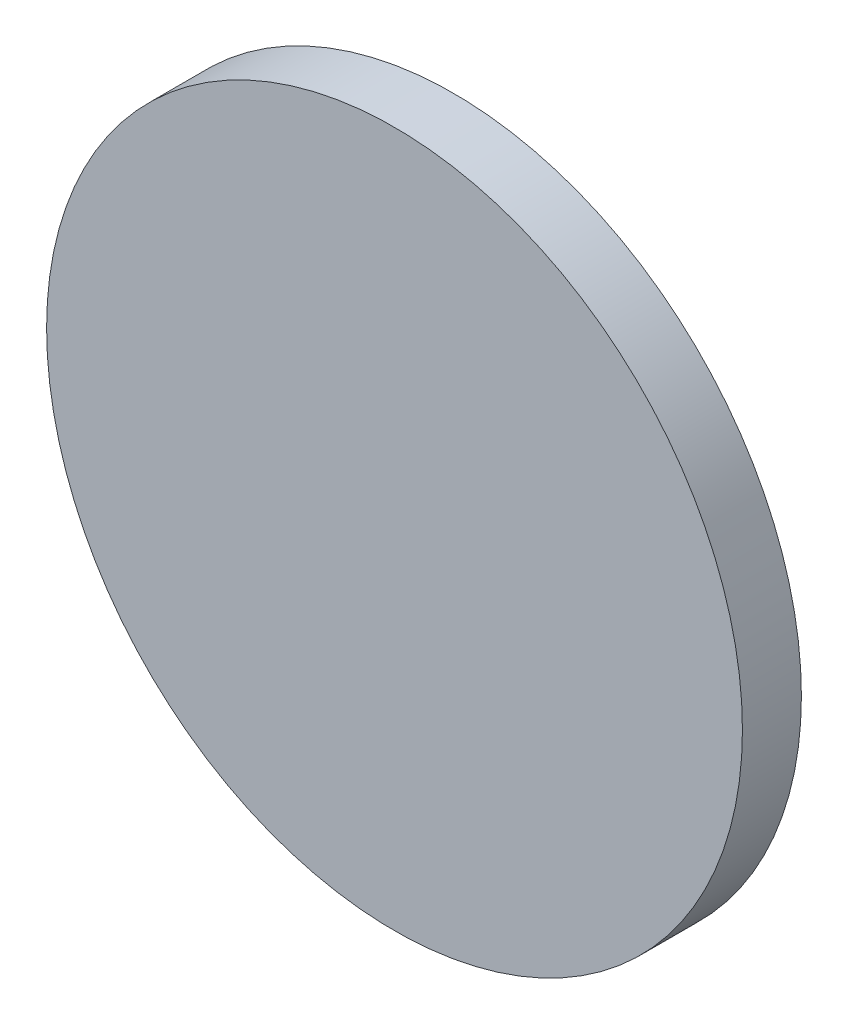
ISO-10303-21;
HEADER;
FILE_DESCRIPTION(('STEP AP214'),'2;1');
FILE_NAME('part.step','',(''),(''),'','','');
FILE_SCHEMA(('AUTOMOTIVE_DESIGN { 1 0 10303 214 1 1 1 1 }'));
ENDSEC;
DATA;
#1=APPLICATION_CONTEXT('core data for automotive mechanical design processes');
#2=APPLICATION_PROTOCOL_DEFINITION('international standard','automotive_design',2000,#1);
#3=PRODUCT_CONTEXT('',#1,'mechanical');
#4=PRODUCT('Part','Part','',(#3));
#5=PRODUCT_RELATED_PRODUCT_CATEGORY('part','',(#4));
#6=PRODUCT_DEFINITION_FORMATION('','',#4);
#7=PRODUCT_DEFINITION_CONTEXT('part definition',#1,'design');
#8=PRODUCT_DEFINITION('design','',#6,#7);
#9=PRODUCT_DEFINITION_SHAPE('','',#8);
#10=(LENGTH_UNIT() NAMED_UNIT(*) SI_UNIT(.MILLI.,.METRE.));
#11=(NAMED_UNIT(*) PLANE_ANGLE_UNIT() SI_UNIT($,.RADIAN.));
#12=(NAMED_UNIT(*) SI_UNIT($,.STERADIAN.) SOLID_ANGLE_UNIT());
#13=UNCERTAINTY_MEASURE_WITH_UNIT(LENGTH_MEASURE(1.E-05),#10,'distance_accuracy_value','');
#14=(GEOMETRIC_REPRESENTATION_CONTEXT(3) GLOBAL_UNCERTAINTY_ASSIGNED_CONTEXT((#13)) GLOBAL_UNIT_ASSIGNED_CONTEXT((#10,
#11,#12)) REPRESENTATION_CONTEXT('',''));
#15=CARTESIAN_POINT('',(0.,0.,0.));
#16=DIRECTION('',(0.,0.,1.));
#17=DIRECTION('',(1.,0.,0.));
#18=AXIS2_PLACEMENT_3D('',#15,#16,#17);
#19=CARTESIAN_POINT('',(0.,0.,60.));
#20=DIRECTION('',(0.,0.,-1.));
#21=DIRECTION('',(-1.,0.,0.));
#22=AXIS2_PLACEMENT_3D('',#19,#20,#21);
#23=CYLINDRICAL_SURFACE('',#22,29.5);
#24=CARTESIAN_POINT('',(0.,0.,0.));
#25=DIRECTION('',(0.,0.,1.));
#26=DIRECTION('',(1.,0.,0.));
#27=AXIS2_PLACEMENT_3D('',#24,#25,#26);
#28=CIRCLE('',#27,29.5);
#29=CARTESIAN_POINT('',(29.5,0.,0.));
#30=VERTEX_POINT('',#29);
#31=EDGE_CURVE('E10',#30,#30,#28,.T.);
#32=ORIENTED_EDGE('',*,*,#31,.T.);
#33=EDGE_LOOP('',(#32));
#34=FACE_BOUND('',#33,.T.);
#35=CARTESIAN_POINT('',(0.,0.,5.));
#36=DIRECTION('',(0.,0.,1.));
#37=DIRECTION('',(1.,0.,0.));
#38=AXIS2_PLACEMENT_3D('',#35,#36,#37);
#39=CIRCLE('',#38,29.5);
#40=CARTESIAN_POINT('',(29.5,0.,5.));
#41=VERTEX_POINT('',#40);
#42=EDGE_CURVE('E36',#41,#41,#39,.T.);
#43=ORIENTED_EDGE('',*,*,#42,.F.);
#44=EDGE_LOOP('',(#43));
#45=FACE_BOUND('',#44,.T.);
#46=ADVANCED_FACE('F33',(#34,#45),#23,.T.);
#47=CARTESIAN_POINT('',(0.,0.,0.));
#48=DIRECTION('',(0.,0.,1.));
#49=DIRECTION('',(1.,0.,0.));
#50=AXIS2_PLACEMENT_3D('',#47,#48,#49);
#51=PLANE('',#50);
#52=CARTESIAN_POINT('',(0.,0.,0.));
#53=DIRECTION('',(0.,0.,-1.));
#54=DIRECTION('',(-1.,0.,0.));
#55=AXIS2_PLACEMENT_3D('',#52,#53,#54);
#56=CIRCLE('',#55,10.1);
#57=CARTESIAN_POINT('',(-10.1,0.,0.));
#58=VERTEX_POINT('',#57);
#59=EDGE_CURVE('E44',#58,#58,#56,.T.);
#60=ORIENTED_EDGE('',*,*,#59,.F.);
#61=EDGE_LOOP('',(#60));
#62=FACE_BOUND('',#61,.T.);
#63=ORIENTED_EDGE('',*,*,#31,.F.);
#64=EDGE_LOOP('',(#63));
#65=FACE_BOUND('',#64,.T.);
#66=ADVANCED_FACE('F56',(#62,#65),#51,.F.);
#67=CARTESIAN_POINT('',(0.,0.,2.));
#68=DIRECTION('',(0.,0.,-1.));
#69=DIRECTION('',(-1.,0.,0.));
#70=AXIS2_PLACEMENT_3D('',#67,#68,#69);
#71=CYLINDRICAL_SURFACE('',#70,10.1);
#72=CARTESIAN_POINT('',(0.,0.,2.));
#73=DIRECTION('',(0.,0.,-1.));
#74=DIRECTION('',(-1.,0.,0.));
#75=AXIS2_PLACEMENT_3D('',#72,#73,#74);
#76=CIRCLE('',#75,10.1);
#77=CARTESIAN_POINT('',(-10.1,0.,2.));
#78=VERTEX_POINT('',#77);
#79=EDGE_CURVE('E40',#78,#78,#76,.T.);
#80=ORIENTED_EDGE('',*,*,#79,.F.);
#81=EDGE_LOOP('',(#80));
#82=FACE_BOUND('',#81,.T.);
#83=ORIENTED_EDGE('',*,*,#59,.T.);
#84=EDGE_LOOP('',(#83));
#85=FACE_BOUND('',#84,.T.);
#86=ADVANCED_FACE('F60',(#82,#85),#71,.F.);
#87=CARTESIAN_POINT('',(0.,0.,2.));
#88=DIRECTION('',(0.,0.,-1.));
#89=DIRECTION('',(-1.,0.,0.));
#90=AXIS2_PLACEMENT_3D('',#87,#88,#89);
#91=PLANE('',#90);
#92=ORIENTED_EDGE('',*,*,#79,.T.);
#93=EDGE_LOOP('',(#92));
#94=FACE_BOUND('',#93,.T.);
#95=ADVANCED_FACE('F65',(#94),#91,.T.);
#96=CARTESIAN_POINT('',(0.,0.,5.));
#97=DIRECTION('',(0.,0.,1.));
#98=DIRECTION('',(1.,0.,0.));
#99=AXIS2_PLACEMENT_3D('',#96,#97,#98);
#100=PLANE('',#99);
#101=ORIENTED_EDGE('',*,*,#42,.T.);
#102=EDGE_LOOP('',(#101));
#103=FACE_BOUND('',#102,.T.);
#104=ADVANCED_FACE('F53',(#103),#100,.T.);
#105=CLOSED_SHELL('',(#46,#66,#86,#95,#104));
#106=MANIFOLD_SOLID_BREP('B2',#105);
#107=ADVANCED_BREP_SHAPE_REPRESENTATION('',(#18,#106),#14);
#108=SHAPE_DEFINITION_REPRESENTATION(#9,#107);
ENDSEC;
END-ISO-10303-21;
